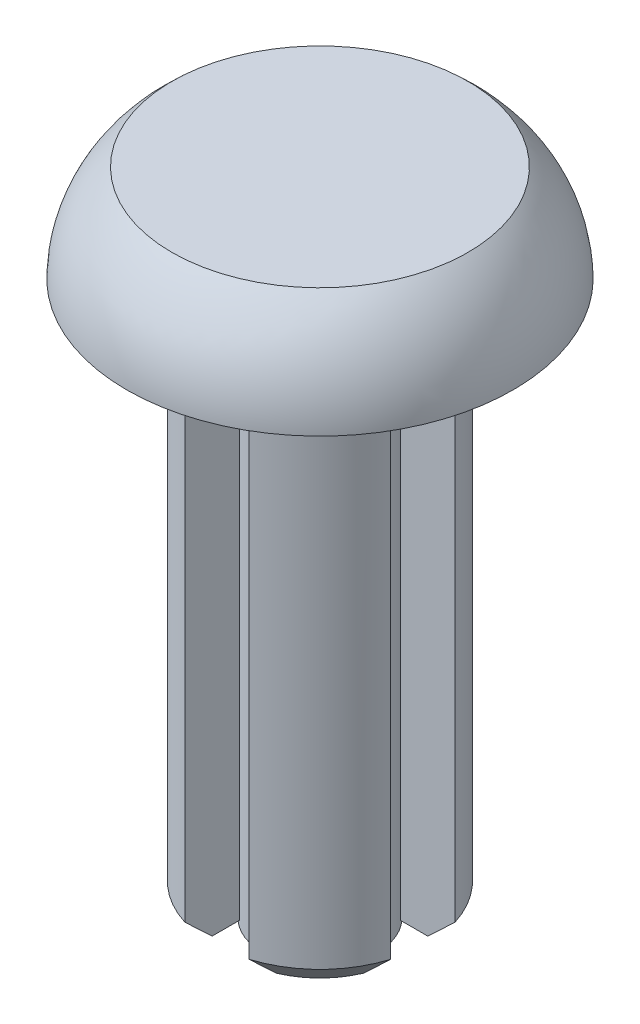
ISO-10303-21;
HEADER;
FILE_DESCRIPTION(('STEP AP214'),'2;1');
FILE_NAME('part.step','',(''),(''),'','','');
FILE_SCHEMA(('AUTOMOTIVE_DESIGN { 1 0 10303 214 1 1 1 1 }'));
ENDSEC;
DATA;
#1=APPLICATION_CONTEXT('core data for automotive mechanical design processes');
#2=APPLICATION_PROTOCOL_DEFINITION('international standard','automotive_design',2000,#1);
#3=PRODUCT_CONTEXT('',#1,'mechanical');
#4=PRODUCT('Part','Part','',(#3));
#5=PRODUCT_RELATED_PRODUCT_CATEGORY('part','',(#4));
#6=PRODUCT_DEFINITION_FORMATION('','',#4);
#7=PRODUCT_DEFINITION_CONTEXT('part definition',#1,'design');
#8=PRODUCT_DEFINITION('design','',#6,#7);
#9=PRODUCT_DEFINITION_SHAPE('','',#8);
#10=(LENGTH_UNIT() NAMED_UNIT(*) SI_UNIT(.MILLI.,.METRE.));
#11=(NAMED_UNIT(*) PLANE_ANGLE_UNIT() SI_UNIT($,.RADIAN.));
#12=(NAMED_UNIT(*) SI_UNIT($,.STERADIAN.) SOLID_ANGLE_UNIT());
#13=UNCERTAINTY_MEASURE_WITH_UNIT(LENGTH_MEASURE(1.E-05),#10,'distance_accuracy_value','');
#14=(GEOMETRIC_REPRESENTATION_CONTEXT(3) GLOBAL_UNCERTAINTY_ASSIGNED_CONTEXT((#13)) GLOBAL_UNIT_ASSIGNED_CONTEXT((#10,
#11,#12)) REPRESENTATION_CONTEXT('',''));
#15=CARTESIAN_POINT('',(0.,0.,0.));
#16=DIRECTION('',(0.,0.,1.));
#17=DIRECTION('',(1.,0.,0.));
#18=AXIS2_PLACEMENT_3D('',#15,#16,#17);
#19=CARTESIAN_POINT('',(0.,1.905,0.));
#20=DIRECTION('',(0.,1.,0.));
#21=DIRECTION('',(0.,0.,1.));
#22=AXIS2_PLACEMENT_3D('',#19,#20,#21);
#23=PLANE('',#22);
#24=CARTESIAN_POINT('',(0.,1.905,0.));
#25=DIRECTION('',(0.,1.,0.));
#26=DIRECTION('',(0.,0.,1.));
#27=AXIS2_PLACEMENT_3D('',#24,#25,#26);
#28=CIRCLE('',#27,2.921);
#29=CARTESIAN_POINT('',(0.,1.905,2.921));
#30=VERTEX_POINT('',#29);
#31=EDGE_CURVE('E19',#30,#30,#28,.F.);
#32=ORIENTED_EDGE('',*,*,#31,.F.);
#33=EDGE_LOOP('',(#32));
#34=FACE_BOUND('',#33,.T.);
#35=ADVANCED_FACE('F16',(#34),#23,.T.);
#36=CARTESIAN_POINT('',(0.,-11.4394,0.));
#37=DIRECTION('',(0.,-1.,0.));
#38=DIRECTION('',(0.,0.,-1.));
#39=AXIS2_PLACEMENT_3D('',#36,#37,#38);
#40=PLANE('',#39);
#41=CARTESIAN_POINT('',(0.,-11.4393999999152,0.));
#42=DIRECTION('',(0.,1.,0.));
#43=DIRECTION('',(0.,0.,1.));
#44=AXIS2_PLACEMENT_3D('',#41,#42,#43);
#45=CIRCLE('',#44,0.634999999988395);
#46=CARTESIAN_POINT('',(0.,-11.4393999999152,0.634999999988395));
#47=VERTEX_POINT('',#46);
#48=EDGE_CURVE('E163',#47,#47,#45,.T.);
#49=ORIENTED_EDGE('',*,*,#48,.F.);
#50=EDGE_LOOP('',(#49));
#51=FACE_BOUND('',#50,.T.);
#52=ADVANCED_FACE('F205',(#51),#40,.T.);
#53=CARTESIAN_POINT('',(0.,-0.0595861521909685,1.19674395959077));
#54=DIRECTION('',(1.,0.,0.));
#55=DIRECTION('',(0.,0.,1.));
#56=AXIS2_PLACEMENT_3D('',#53,#54,#55);
#57=CIRCLE('',#56,2.61393527889813);
#58=TRIMMED_CURVE('',#57,(PARAMETER_VALUE(-2.04635172054682)),
(PARAMETER_VALUE(2.04635172054682)),.T.,.PARAMETER.);
#59=CARTESIAN_POINT('',(0.,-0.0595861521909685,0.));
#60=DIRECTION('',(0.,1.,0.));
#61=AXIS1_PLACEMENT('',#59,#60);
#62=SURFACE_OF_REVOLUTION('',#58,#61);
#63=ORIENTED_EDGE('',*,*,#31,.T.);
#64=EDGE_LOOP('',(#63));
#65=FACE_BOUND('',#64,.T.);
#66=CARTESIAN_POINT('',(0.,0.,0.));
#67=DIRECTION('',(0.,1.,0.));
#68=DIRECTION('',(0.,0.,1.));
#69=AXIS2_PLACEMENT_3D('',#66,#67,#68);
#70=CIRCLE('',#69,3.80999999998721);
#71=CARTESIAN_POINT('',(0.,0.,3.80999999998721));
#72=VERTEX_POINT('',#71);
#73=EDGE_CURVE('E195',#72,#72,#70,.F.);
#74=ORIENTED_EDGE('',*,*,#73,.F.);
#75=EDGE_LOOP('',(#74));
#76=FACE_BOUND('',#75,.T.);
#77=ADVANCED_FACE('F201',(#65,#76),#62,.F.);
#78=CARTESIAN_POINT('',(0.,-10.8044,0.));
#79=DIRECTION('',(0.,-1.,0.));
#80=DIRECTION('',(0.,0.,-1.));
#81=AXIS2_PLACEMENT_3D('',#78,#79,#80);
#82=PLANE('',#81);
#83=DIRECTION('',(0.,0.,-1.));
#84=VECTOR('',#83,1.);
#85=CARTESIAN_POINT('',(0.635000000000001,-10.8044,2.03026292940102));
#86=LINE('',#85,#84);
#87=CARTESIAN_POINT('',(0.635000000000001,-10.8043999999918,1.48954542139407));
#88=VERTEX_POINT('',#87);
#89=CARTESIAN_POINT('',(0.635,-10.8044,0.950380976240581));
#90=VERTEX_POINT('',#89);
#91=EDGE_CURVE('E358',#88,#90,#86,.T.);
#92=ORIENTED_EDGE('',*,*,#91,.T.);
#93=CARTESIAN_POINT('',(0.,-10.8044,0.));
#94=DIRECTION('',(0.,1.,0.));
#95=DIRECTION('',(0.,0.,1.));
#96=AXIS2_PLACEMENT_3D('',#93,#94,#95);
#97=CIRCLE('',#96,1.143);
#98=CARTESIAN_POINT('',(0.950380976240581,-10.8044,0.635));
#99=VERTEX_POINT('',#98);
#100=EDGE_CURVE('E162',#99,#90,#97,.F.);
#101=ORIENTED_EDGE('',*,*,#100,.F.);
#102=DIRECTION('',(1.,0.,0.));
#103=VECTOR('',#102,1.);
#104=CARTESIAN_POINT('',(0.635,-10.8044,0.635));
#105=LINE('',#104,#103);
#106=CARTESIAN_POINT('',(1.48954542139407,-10.8043999999918,0.635));
#107=VERTEX_POINT('',#106);
#108=EDGE_CURVE('E189',#99,#107,#105,.T.);
#109=ORIENTED_EDGE('',*,*,#108,.T.);
#110=CARTESIAN_POINT('',(0.,-10.8043999999836,0.));
#111=DIRECTION('',(0.,1.,0.));
#112=DIRECTION('',(0.,0.,1.));
#113=AXIS2_PLACEMENT_3D('',#110,#111,#112);
#114=CIRCLE('',#113,1.61924999997609);
#115=EDGE_CURVE('E190',#88,#107,#114,.T.);
#116=ORIENTED_EDGE('',*,*,#115,.F.);
#117=EDGE_LOOP('',(#92,#101,#109,#116));
#118=FACE_BOUND('',#117,.T.);
#119=ADVANCED_FACE('F204',(#118),#82,.T.);
#120=CARTESIAN_POINT('',(0.,-10.8044,0.));
#121=DIRECTION('',(0.,-1.,0.));
#122=DIRECTION('',(0.,0.,-1.));
#123=AXIS2_PLACEMENT_3D('',#120,#121,#122);
#124=PLANE('',#123);
#125=DIRECTION('',(-1.,0.,0.));
#126=VECTOR('',#125,1.);
#127=CARTESIAN_POINT('',(0.635,-10.8044,-0.635));
#128=LINE('',#127,#126);
#129=CARTESIAN_POINT('',(1.48954542133228,-10.8043999999918,-0.635));
#130=VERTEX_POINT('',#129);
#131=CARTESIAN_POINT('',(0.950380976240581,-10.8044,-0.635));
#132=VERTEX_POINT('',#131);
#133=EDGE_CURVE('E166',#130,#132,#128,.T.);
#134=ORIENTED_EDGE('',*,*,#133,.T.);
#135=CARTESIAN_POINT('',(0.,-10.8044,0.));
#136=DIRECTION('',(0.,1.,0.));
#137=DIRECTION('',(0.,0.,1.));
#138=AXIS2_PLACEMENT_3D('',#135,#136,#137);
#139=CIRCLE('',#138,1.143);
#140=CARTESIAN_POINT('',(0.635,-10.8044,-0.950380976240581));
#141=VERTEX_POINT('',#140);
#142=EDGE_CURVE('E150',#141,#132,#139,.F.);
#143=ORIENTED_EDGE('',*,*,#142,.F.);
#144=DIRECTION('',(0.,0.,-1.));
#145=VECTOR('',#144,1.);
#146=CARTESIAN_POINT('',(0.635,-10.8044,-0.635));
#147=LINE('',#146,#145);
#148=CARTESIAN_POINT('',(0.635000000000001,-10.8043999999918,-1.48954542133228));
#149=VERTEX_POINT('',#148);
#150=EDGE_CURVE('E337',#141,#149,#147,.T.);
#151=ORIENTED_EDGE('',*,*,#150,.T.);
#152=CARTESIAN_POINT('',(0.,-10.8043999999836,0.));
#153=DIRECTION('',(0.,1.,0.));
#154=DIRECTION('',(0.,0.,1.));
#155=AXIS2_PLACEMENT_3D('',#152,#153,#154);
#156=CIRCLE('',#155,1.61924999991925);
#157=EDGE_CURVE('E169',#130,#149,#156,.T.);
#158=ORIENTED_EDGE('',*,*,#157,.F.);
#159=EDGE_LOOP('',(#134,#143,#151,#158));
#160=FACE_BOUND('',#159,.T.);
#161=ADVANCED_FACE('F167',(#160),#124,.T.);
#162=CARTESIAN_POINT('',(0.,-10.9313999999472,0.));
#163=DIRECTION('',(0.,1.,0.));
#164=DIRECTION('',(0.,0.,1.));
#165=AXIS2_PLACEMENT_3D('',#162,#163,#164);
#166=CONICAL_SURFACE('',#165,1.14299999995637,0.785398163397448);
#167=ORIENTED_EDGE('',*,*,#48,.T.);
#168=EDGE_LOOP('',(#167));
#169=FACE_BOUND('',#168,.T.);
#170=CARTESIAN_POINT('',(0.,-10.9314,0.));
#171=DIRECTION('',(0.,1.,0.));
#172=DIRECTION('',(0.,0.,1.));
#173=AXIS2_PLACEMENT_3D('',#170,#171,#172);
#174=CIRCLE('',#173,1.143);
#175=CARTESIAN_POINT('',(0.,-10.9314,1.143));
#176=VERTEX_POINT('',#175);
#177=EDGE_CURVE('E366',#176,#176,#174,.T.);
#178=ORIENTED_EDGE('',*,*,#177,.F.);
#179=EDGE_LOOP('',(#178));
#180=FACE_BOUND('',#179,.T.);
#181=ADVANCED_FACE('F433',(#169,#180),#166,.T.);
#182=CARTESIAN_POINT('',(0.,0.,0.));
#183=DIRECTION('',(0.,1.,0.));
#184=DIRECTION('',(0.,0.,1.));
#185=AXIS2_PLACEMENT_3D('',#182,#183,#184);
#186=CONICAL_SURFACE('',#185,3.80999999993037,1.54799877919605);
#187=ORIENTED_EDGE('',*,*,#73,.T.);
#188=EDGE_LOOP('',(#187));
#189=FACE_BOUND('',#188,.T.);
#190=CARTESIAN_POINT('',(0.,-0.0227955728942452,0.));
#191=DIRECTION('',(0.,1.,0.));
#192=DIRECTION('',(0.,0.,1.));
#193=AXIS2_PLACEMENT_3D('',#190,#191,#192);
#194=CIRCLE('',#193,2.81025985283353);
#195=CARTESIAN_POINT('',(0.,-0.0227955728942452,2.81025985283353));
#196=VERTEX_POINT('',#195);
#197=EDGE_CURVE('E324',#196,#196,#194,.T.);
#198=ORIENTED_EDGE('',*,*,#197,.T.);
#199=EDGE_LOOP('',(#198));
#200=FACE_BOUND('',#199,.T.);
#201=ADVANCED_FACE('F430',(#189,#200),#186,.T.);
#202=CARTESIAN_POINT('',(0.635000000000001,-0.644399999999998,2.03026292940102));
#203=DIRECTION('',(1.,0.,0.));
#204=DIRECTION('',(0.,0.,-1.));
#205=AXIS2_PLACEMENT_3D('',#202,#203,#204);
#206=PLANE('',#205);
#207=CARTESIAN_POINT('',(0.635000000000001,-10.2963999999739,2.03026292938615));
#208=CARTESIAN_POINT('',(0.635000000000001,-10.3390858324256,1.98553535088088));
#209=CARTESIAN_POINT('',(0.635000000000001,-10.3817085821733,1.94074736694082));
#210=CARTESIAN_POINT('',(0.635000000000001,-10.4667920637135,1.85101953980129));
#211=CARTESIAN_POINT('',(0.635000000000001,-10.5092527987847,1.80607969970996));
#212=CARTESIAN_POINT('',(0.635000000000001,-10.5939784631004,1.71601494909532));
#213=CARTESIAN_POINT('',(0.635000000000001,-10.6362433908405,1.67089003715512));
#214=CARTESIAN_POINT('',(0.635000000000001,-10.7205231739316,1.580405652873));
#215=CARTESIAN_POINT('',(0.635000000000001,-10.762538024149,1.53504617575149));
#216=CARTESIAN_POINT('',(0.635000000000001,-10.8043999999848,1.48954542140173));
#217=B_SPLINE_CURVE_WITH_KNOTS('',3,(#207,#208,#209,#210,#211,#212,#213,#214,#215,#216),
.UNSPECIFIED.,.F.,.F.,(4,2,2,2,4),(0.,0.185482565147711,0.370961356623039,0.556441570750558,
0.741925579300346),.UNSPECIFIED.);
#218=CARTESIAN_POINT('',(0.635000000000001,-10.296399999987,2.03026292939358));
#219=VERTEX_POINT('',#218);
#220=EDGE_CURVE('E361',#219,#88,#217,.T.);
#221=ORIENTED_EDGE('',*,*,#220,.F.);
#222=DIRECTION('',(0.,1.,0.));
#223=VECTOR('',#222,1.);
#224=CARTESIAN_POINT('',(0.635000000000001,-10.8044,2.03026292940102));
#225=LINE('',#224,#223);
#226=CARTESIAN_POINT('',(0.635000000000001,-0.644399999999998,2.03026292940102));
#227=VERTEX_POINT('',#226);
#228=EDGE_CURVE('E320',#227,#219,#225,.F.);
#229=ORIENTED_EDGE('',*,*,#228,.F.);
#230=DIRECTION('',(0.,0.,-1.));
#231=VECTOR('',#230,1.);
#232=CARTESIAN_POINT('',(0.635000000000001,-0.644399999999998,2.03026292940102));
#233=LINE('',#232,#231);
#234=CARTESIAN_POINT('',(0.635,-0.644399999999998,0.950380976240581));
#235=VERTEX_POINT('',#234);
#236=EDGE_CURVE('E194',#235,#227,#233,.F.);
#237=ORIENTED_EDGE('',*,*,#236,.F.);
#238=DIRECTION('',(0.,1.,0.));
#239=VECTOR('',#238,1.);
#240=CARTESIAN_POINT('',(0.635,-0.644399999999998,0.950380976240581));
#241=LINE('',#240,#239);
#242=EDGE_CURVE('E191',#90,#235,#241,.T.);
#243=ORIENTED_EDGE('',*,*,#242,.F.);
#244=ORIENTED_EDGE('',*,*,#91,.F.);
#245=EDGE_LOOP('',(#221,#229,#237,#243,#244));
#246=FACE_BOUND('',#245,.T.);
#247=ADVANCED_FACE('F413',(#246),#206,.F.);
#248=CARTESIAN_POINT('',(0.,-10.2963999999588,0.));
#249=DIRECTION('',(0.,1.,0.));
#250=DIRECTION('',(0.,0.,1.));
#251=AXIS2_PLACEMENT_3D('',#248,#249,#250);
#252=CONICAL_SURFACE('',#251,2.12725000000091,0.785398163397448);
#253=ORIENTED_EDGE('',*,*,#220,.T.);
#254=ORIENTED_EDGE('',*,*,#115,.T.);
#255=CARTESIAN_POINT('',(1.48954542140814,-10.8043999999789,0.635));
#256=CARTESIAN_POINT('',(1.53504617575691,-10.762538024144,0.635));
#257=CARTESIAN_POINT('',(1.58040565287744,-10.7205231739275,0.635));
#258=CARTESIAN_POINT('',(1.6708900371576,-10.6362433908382,0.635));
#259=CARTESIAN_POINT('',(1.71601494909682,-10.5939784630989,0.635));
#260=CARTESIAN_POINT('',(1.80607969970952,-10.5092527987851,0.635));
#261=CARTESIAN_POINT('',(1.85101953979988,-10.4667920637149,0.635));
#262=CARTESIAN_POINT('',(1.94074736693748,-10.3817085821765,0.635));
#263=CARTESIAN_POINT('',(1.98553535087658,-10.3390858324297,0.635));
#264=CARTESIAN_POINT('',(2.03026292938089,-10.2963999999789,0.635));
#265=B_SPLINE_CURVE_WITH_KNOTS('',3,(#255,#256,#257,#258,#259,#260,#261,#262,#263,#264),
.UNSPECIFIED.,.F.,.F.,(4,2,2,2,4),(0.,0.185484008545792,0.370964222669312,0.556443014140646,
0.74192557928436),.UNSPECIFIED.);
#266=CARTESIAN_POINT('',(2.03026292939095,-10.2963999999895,0.635));
#267=VERTEX_POINT('',#266);
#268=EDGE_CURVE('E351',#107,#267,#265,.T.);
#269=ORIENTED_EDGE('',*,*,#268,.T.);
#270=CARTESIAN_POINT('',(0.,-10.2964,0.));
#271=DIRECTION('',(0.,1.,0.));
#272=DIRECTION('',(0.,0.,1.));
#273=AXIS2_PLACEMENT_3D('',#270,#271,#272);
#274=CIRCLE('',#273,2.12725);
#275=EDGE_CURVE('E323',#219,#267,#274,.T.);
#276=ORIENTED_EDGE('',*,*,#275,.F.);
#277=EDGE_LOOP('',(#253,#254,#269,#276));
#278=FACE_BOUND('',#277,.T.);
#279=ADVANCED_FACE('F409',(#278),#252,.T.);
#280=CARTESIAN_POINT('',(0.635,-0.644399999999998,0.635));
#281=DIRECTION('',(0.,0.,1.));
#282=DIRECTION('',(1.,0.,0.));
#283=AXIS2_PLACEMENT_3D('',#280,#281,#282);
#284=PLANE('',#283);
#285=ORIENTED_EDGE('',*,*,#268,.F.);
#286=ORIENTED_EDGE('',*,*,#108,.F.);
#287=DIRECTION('',(0.,1.,0.));
#288=VECTOR('',#287,1.);
#289=CARTESIAN_POINT('',(0.950380976240581,-0.644399999999998,0.635));
#290=LINE('',#289,#288);
#291=CARTESIAN_POINT('',(0.950380976240581,-0.644399999999998,0.635));
#292=VERTEX_POINT('',#291);
#293=EDGE_CURVE('E186',#292,#99,#290,.F.);
#294=ORIENTED_EDGE('',*,*,#293,.F.);
#295=DIRECTION('',(1.,0.,0.));
#296=VECTOR('',#295,1.);
#297=CARTESIAN_POINT('',(0.,-0.644399999999998,0.635));
#298=LINE('',#297,#296);
#299=CARTESIAN_POINT('',(2.03026292940102,-0.644399999999998,0.635));
#300=VERTEX_POINT('',#299);
#301=EDGE_CURVE('E181',#300,#292,#298,.F.);
#302=ORIENTED_EDGE('',*,*,#301,.F.);
#303=DIRECTION('',(0.,1.,0.));
#304=VECTOR('',#303,1.);
#305=CARTESIAN_POINT('',(2.03026292940102,-10.8044,0.635));
#306=LINE('',#305,#304);
#307=EDGE_CURVE('E352',#267,#300,#306,.T.);
#308=ORIENTED_EDGE('',*,*,#307,.F.);
#309=EDGE_LOOP('',(#285,#286,#294,#302,#308));
#310=FACE_BOUND('',#309,.T.);
#311=ADVANCED_FACE('F407',(#310),#284,.F.);
#312=CARTESIAN_POINT('',(0.,-0.644399999999998,0.));
#313=DIRECTION('',(0.,-1.,0.));
#314=DIRECTION('',(0.,0.,-1.));
#315=AXIS2_PLACEMENT_3D('',#312,#313,#314);
#316=PLANE('',#315);
#317=DIRECTION('',(-1.,0.,0.));
#318=VECTOR('',#317,1.);
#319=CARTESIAN_POINT('',(0.635,-0.644399999999998,-0.635));
#320=LINE('',#319,#318);
#321=CARTESIAN_POINT('',(0.950380976240581,-0.644399999999998,-0.635));
#322=VERTEX_POINT('',#321);
#323=CARTESIAN_POINT('',(2.03026292940102,-0.644399999999998,-0.635));
#324=VERTEX_POINT('',#323);
#325=EDGE_CURVE('E173',#322,#324,#320,.F.);
#326=ORIENTED_EDGE('',*,*,#325,.T.);
#327=CARTESIAN_POINT('',(0.,-0.644399999999998,0.));
#328=DIRECTION('',(0.,1.,0.));
#329=DIRECTION('',(0.,0.,1.));
#330=AXIS2_PLACEMENT_3D('',#327,#328,#329);
#331=CIRCLE('',#330,2.12725);
#332=EDGE_CURVE('E347',#300,#324,#331,.T.);
#333=ORIENTED_EDGE('',*,*,#332,.F.);
#334=ORIENTED_EDGE('',*,*,#301,.T.);
#335=CARTESIAN_POINT('',(0.,-0.644399999999998,0.));
#336=DIRECTION('',(0.,1.,0.));
#337=DIRECTION('',(0.,0.,1.));
#338=AXIS2_PLACEMENT_3D('',#335,#336,#337);
#339=CIRCLE('',#338,1.143);
#340=EDGE_CURVE('E178',#292,#322,#339,.T.);
#341=ORIENTED_EDGE('',*,*,#340,.T.);
#342=EDGE_LOOP('',(#326,#333,#334,#341));
#343=FACE_BOUND('',#342,.T.);
#344=ADVANCED_FACE('F504',(#343),#316,.T.);
#345=CARTESIAN_POINT('',(0.635,-0.644399999999998,-0.635));
#346=DIRECTION('',(0.,0.,-1.));
#347=DIRECTION('',(-1.,0.,0.));
#348=AXIS2_PLACEMENT_3D('',#345,#346,#347);
#349=PLANE('',#348);
#350=CARTESIAN_POINT('',(2.03026292935776,-10.2963999999441,-0.635));
#351=CARTESIAN_POINT('',(1.98553535085204,-10.3390858323963,-0.635));
#352=CARTESIAN_POINT('',(1.94074736691151,-10.3817085821444,-0.635));
#353=CARTESIAN_POINT('',(1.85101953977105,-10.4667920636853,-0.635));
#354=CARTESIAN_POINT('',(1.80607969967926,-10.5092527987568,-0.635));
#355=CARTESIAN_POINT('',(1.71601494906366,-10.5939784630732,-0.635));
#356=CARTESIAN_POINT('',(1.67089003712298,-10.6362433908137,-0.635));
#357=CARTESIAN_POINT('',(1.58040565283988,-10.7205231739055,-0.635));
#358=CARTESIAN_POINT('',(1.53504617571787,-10.7625380241232,-0.635));
#359=CARTESIAN_POINT('',(1.4895454213676,-10.8043999999593,-0.635));
#360=B_SPLINE_CURVE_WITH_KNOTS('',3,(#350,#351,#352,#353,#354,#355,#356,#357,#358,#359),
.UNSPECIFIED.,.F.,.F.,(4,2,2,2,4),(0.,0.185482565149494,0.370961356626607,0.556441570755906,
0.741925579307479),.UNSPECIFIED.);
#361=CARTESIAN_POINT('',(2.03026292937939,-10.2963999999721,-0.635));
#362=VERTEX_POINT('',#361);
#363=EDGE_CURVE('E172',#362,#130,#360,.T.);
#364=ORIENTED_EDGE('',*,*,#363,.F.);
#365=DIRECTION('',(0.,1.,0.));
#366=VECTOR('',#365,1.);
#367=CARTESIAN_POINT('',(2.03026292940102,-10.8044,-0.635));
#368=LINE('',#367,#366);
#369=EDGE_CURVE('E342',#324,#362,#368,.F.);
#370=ORIENTED_EDGE('',*,*,#369,.F.);
#371=ORIENTED_EDGE('',*,*,#325,.F.);
#372=DIRECTION('',(0.,1.,0.));
#373=VECTOR('',#372,1.);
#374=CARTESIAN_POINT('',(0.950380976240581,-0.644399999999998,-0.635));
#375=LINE('',#374,#373);
#376=EDGE_CURVE('E155',#132,#322,#375,.T.);
#377=ORIENTED_EDGE('',*,*,#376,.F.);
#378=ORIENTED_EDGE('',*,*,#133,.F.);
#379=EDGE_LOOP('',(#364,#370,#371,#377,#378));
#380=FACE_BOUND('',#379,.T.);
#381=ADVANCED_FACE('F176',(#380),#349,.F.);
#382=CARTESIAN_POINT('',(0.,-10.2964000000156,0.));
#383=DIRECTION('',(0.,1.,0.));
#384=DIRECTION('',(0.,0.,1.));
#385=AXIS2_PLACEMENT_3D('',#382,#383,#384);
#386=CONICAL_SURFACE('',#385,2.12724999988723,0.785398163397448);
#387=ORIENTED_EDGE('',*,*,#363,.T.);
#388=ORIENTED_EDGE('',*,*,#157,.T.);
#389=CARTESIAN_POINT('',(0.635000000015535,-10.8043999999619,-1.48954542138207));
#390=CARTESIAN_POINT('',(0.63500000000561,-10.7625380241212,-1.53504617572625));
#391=CARTESIAN_POINT('',(0.635000000001511,-10.7205231739021,-1.58040565284516));
#392=CARTESIAN_POINT('',(0.63499999999849,-10.6362433908105,-1.67089003712473));
#393=CARTESIAN_POINT('',(0.634999999999569,-10.5939784630715,-1.71601494906497));
#394=CARTESIAN_POINT('',(0.635000000000432,-10.5092527987574,-1.80607969967905));
#395=CARTESIAN_POINT('',(0.635000000000217,-10.4667920636867,-1.85101953976977));
#396=CARTESIAN_POINT('',(0.634999999999785,-10.3817085821474,-1.94074736690808));
#397=CARTESIAN_POINT('',(0.634999999999569,-10.3390858324001,-1.98553535084752));
#398=CARTESIAN_POINT('',(0.635000000000001,-10.2963999999492,-2.0302629293525));
#399=B_SPLINE_CURVE_WITH_KNOTS('',3,(#389,#390,#391,#392,#393,#394,#395,#396,#397,#398),
.UNSPECIFIED.,.F.,.F.,(4,2,2,2,4),(0.,0.185484008547495,0.370964222672752,0.556443014145866,
0.741925579291334),.UNSPECIFIED.);
#400=CARTESIAN_POINT('',(0.635000000000001,-10.2963999999746,-2.03026292937676));
#401=VERTEX_POINT('',#400);
#402=EDGE_CURVE('E339',#149,#401,#399,.T.);
#403=ORIENTED_EDGE('',*,*,#402,.T.);
#404=CARTESIAN_POINT('',(0.,-10.2964,0.));
#405=DIRECTION('',(0.,1.,0.));
#406=DIRECTION('',(0.,0.,1.));
#407=AXIS2_PLACEMENT_3D('',#404,#405,#406);
#408=CIRCLE('',#407,2.12725);
#409=EDGE_CURVE('E336',#362,#401,#408,.T.);
#410=ORIENTED_EDGE('',*,*,#409,.F.);
#411=EDGE_LOOP('',(#387,#388,#403,#410));
#412=FACE_BOUND('',#411,.T.);
#413=ADVANCED_FACE('F389',(#412),#386,.T.);
#414=CARTESIAN_POINT('',(0.635,-0.644399999999998,-0.635));
#415=DIRECTION('',(1.,0.,0.));
#416=DIRECTION('',(0.,0.,-1.));
#417=AXIS2_PLACEMENT_3D('',#414,#415,#416);
#418=PLANE('',#417);
#419=ORIENTED_EDGE('',*,*,#402,.F.);
#420=ORIENTED_EDGE('',*,*,#150,.F.);
#421=DIRECTION('',(0.,1.,0.));
#422=VECTOR('',#421,1.);
#423=CARTESIAN_POINT('',(0.635,-0.644399999999998,-0.950380976240581));
#424=LINE('',#423,#422);
#425=CARTESIAN_POINT('',(0.635,-0.644399999999998,-0.950380976240581));
#426=VERTEX_POINT('',#425);
#427=EDGE_CURVE('E159',#426,#141,#424,.F.);
#428=ORIENTED_EDGE('',*,*,#427,.F.);
#429=DIRECTION('',(0.,0.,-1.));
#430=VECTOR('',#429,1.);
#431=CARTESIAN_POINT('',(0.635,-0.644399999999998,-0.635));
#432=LINE('',#431,#430);
#433=CARTESIAN_POINT('',(0.635000000000001,-0.644399999999998,-2.03026292940102));
#434=VERTEX_POINT('',#433);
#435=EDGE_CURVE('E343',#434,#426,#432,.F.);
#436=ORIENTED_EDGE('',*,*,#435,.F.);
#437=DIRECTION('',(0.,1.,0.));
#438=VECTOR('',#437,1.);
#439=CARTESIAN_POINT('',(0.635000000000002,-10.8044,-2.03026292940102));
#440=LINE('',#439,#438);
#441=EDGE_CURVE('E333',#401,#434,#440,.T.);
#442=ORIENTED_EDGE('',*,*,#441,.F.);
#443=EDGE_LOOP('',(#419,#420,#428,#436,#442));
#444=FACE_BOUND('',#443,.T.);
#445=ADVANCED_FACE('F386',(#444),#418,.F.);
#446=CARTESIAN_POINT('',(0.,-10.8044,0.));
#447=DIRECTION('',(0.,-1.,0.));
#448=DIRECTION('',(0.,0.,-1.));
#449=AXIS2_PLACEMENT_3D('',#446,#447,#448);
#450=PLANE('',#449);
#451=DIRECTION('',(0.,0.,1.));
#452=VECTOR('',#451,1.);
#453=CARTESIAN_POINT('',(-0.635,-10.8044,-0.635));
#454=LINE('',#453,#452);
#455=CARTESIAN_POINT('',(-0.635,-10.8043999999634,-1.48954542136318));
#456=VERTEX_POINT('',#455);
#457=CARTESIAN_POINT('',(-0.635,-10.8044,-0.950380976240581));
#458=VERTEX_POINT('',#457);
#459=EDGE_CURVE('E296',#456,#458,#454,.T.);
#460=ORIENTED_EDGE('',*,*,#459,.T.);
#461=CARTESIAN_POINT('',(0.,-10.8044,0.));
#462=DIRECTION('',(0.,1.,0.));
#463=DIRECTION('',(0.,0.,1.));
#464=AXIS2_PLACEMENT_3D('',#461,#462,#463);
#465=CIRCLE('',#464,1.143);
#466=CARTESIAN_POINT('',(-0.950380976240581,-10.8044,-0.635));
#467=VERTEX_POINT('',#466);
#468=EDGE_CURVE('E371',#467,#458,#465,.F.);
#469=ORIENTED_EDGE('',*,*,#468,.F.);
#470=DIRECTION('',(-1.,0.,0.));
#471=VECTOR('',#470,1.);
#472=CARTESIAN_POINT('',(-2.03026292940102,-10.8044,-0.635));
#473=LINE('',#472,#471);
#474=CARTESIAN_POINT('',(-1.48954542136318,-10.8043999999634,-0.635));
#475=VERTEX_POINT('',#474);
#476=EDGE_CURVE('E285',#467,#475,#473,.T.);
#477=ORIENTED_EDGE('',*,*,#476,.T.);
#478=CARTESIAN_POINT('',(0.,-10.8043999999268,0.));
#479=DIRECTION('',(0.,1.,0.));
#480=DIRECTION('',(0.,0.,1.));
#481=AXIS2_PLACEMENT_3D('',#478,#479,#480);
#482=CIRCLE('',#481,1.61924999997609);
#483=EDGE_CURVE('E286',#456,#475,#482,.T.);
#484=ORIENTED_EDGE('',*,*,#483,.F.);
#485=EDGE_LOOP('',(#460,#469,#477,#484));
#486=FACE_BOUND('',#485,.T.);
#487=ADVANCED_FACE('F478',(#486),#450,.T.);
#488=CARTESIAN_POINT('',(0.,-11.4394,0.));
#489=DIRECTION('',(0.,1.,0.));
#490=DIRECTION('',(0.,0.,1.));
#491=AXIS2_PLACEMENT_3D('',#488,#489,#490);
#492=CYLINDRICAL_SURFACE('',#491,1.143);
#493=ORIENTED_EDGE('',*,*,#177,.T.);
#494=EDGE_LOOP('',(#493));
#495=FACE_BOUND('',#494,.T.);
#496=DIRECTION('',(0.,1.,0.));
#497=VECTOR('',#496,1.);
#498=CARTESIAN_POINT('',(-0.635,-0.644399999999998,-0.950380976240581));
#499=LINE('',#498,#497);
#500=CARTESIAN_POINT('',(-0.635,-0.644399999999998,-0.950380976240581));
#501=VERTEX_POINT('',#500);
#502=EDGE_CURVE('E331',#458,#501,#499,.T.);
#503=ORIENTED_EDGE('',*,*,#502,.T.);
#504=CARTESIAN_POINT('',(0.,-0.644399999999998,0.));
#505=DIRECTION('',(0.,1.,0.));
#506=DIRECTION('',(0.,0.,1.));
#507=AXIS2_PLACEMENT_3D('',#504,#505,#506);
#508=CIRCLE('',#507,1.143);
#509=EDGE_CURVE('E297',#426,#501,#508,.T.);
#510=ORIENTED_EDGE('',*,*,#509,.F.);
#511=ORIENTED_EDGE('',*,*,#427,.T.);
#512=ORIENTED_EDGE('',*,*,#142,.T.);
#513=ORIENTED_EDGE('',*,*,#376,.T.);
#514=ORIENTED_EDGE('',*,*,#340,.F.);
#515=ORIENTED_EDGE('',*,*,#293,.T.);
#516=ORIENTED_EDGE('',*,*,#100,.T.);
#517=ORIENTED_EDGE('',*,*,#242,.T.);
#518=CARTESIAN_POINT('',(0.,-0.644399999999998,0.));
#519=DIRECTION('',(0.,1.,0.));
#520=DIRECTION('',(0.,0.,1.));
#521=AXIS2_PLACEMENT_3D('',#518,#519,#520);
#522=CIRCLE('',#521,1.143);
#523=CARTESIAN_POINT('',(-0.635,-0.644399999999998,0.950380976240581));
#524=VERTEX_POINT('',#523);
#525=EDGE_CURVE('E368',#235,#524,#522,.F.);
#526=ORIENTED_EDGE('',*,*,#525,.T.);
#527=DIRECTION('',(0.,1.,0.));
#528=VECTOR('',#527,1.);
#529=CARTESIAN_POINT('',(-0.635,-0.644399999999998,0.950380976240581));
#530=LINE('',#529,#528);
#531=CARTESIAN_POINT('',(-0.635,-10.8044,0.950380976240581));
#532=VERTEX_POINT('',#531);
#533=EDGE_CURVE('E252',#524,#532,#530,.F.);
#534=ORIENTED_EDGE('',*,*,#533,.T.);
#535=CARTESIAN_POINT('',(0.,-10.8044,0.));
#536=DIRECTION('',(0.,1.,0.));
#537=DIRECTION('',(0.,0.,1.));
#538=AXIS2_PLACEMENT_3D('',#535,#536,#537);
#539=CIRCLE('',#538,1.143);
#540=CARTESIAN_POINT('',(-0.950380976240581,-10.8044,0.635));
#541=VERTEX_POINT('',#540);
#542=EDGE_CURVE('E365',#541,#532,#539,.T.);
#543=ORIENTED_EDGE('',*,*,#542,.F.);
#544=DIRECTION('',(0.,1.,0.));
#545=VECTOR('',#544,1.);
#546=CARTESIAN_POINT('',(-0.950380976240581,-0.644399999999998,0.635));
#547=LINE('',#546,#545);
#548=CARTESIAN_POINT('',(-0.950380976240581,-0.644399999999998,0.635));
#549=VERTEX_POINT('',#548);
#550=EDGE_CURVE('E326',#541,#549,#547,.T.);
#551=ORIENTED_EDGE('',*,*,#550,.T.);
#552=CARTESIAN_POINT('',(0.,-0.644399999999998,0.));
#553=DIRECTION('',(0.,1.,0.));
#554=DIRECTION('',(0.,0.,1.));
#555=AXIS2_PLACEMENT_3D('',#552,#553,#554);
#556=CIRCLE('',#555,1.143);
#557=CARTESIAN_POINT('',(-0.950380976240581,-0.644399999999998,-0.635));
#558=VERTEX_POINT('',#557);
#559=EDGE_CURVE('E260',#558,#549,#556,.T.);
#560=ORIENTED_EDGE('',*,*,#559,.F.);
#561=DIRECTION('',(0.,1.,0.));
#562=VECTOR('',#561,1.);
#563=CARTESIAN_POINT('',(-0.950380976240581,-0.644399999999998,-0.635));
#564=LINE('',#563,#562);
#565=EDGE_CURVE('E289',#558,#467,#564,.F.);
#566=ORIENTED_EDGE('',*,*,#565,.T.);
#567=ORIENTED_EDGE('',*,*,#468,.T.);
#568=EDGE_LOOP('',(#503,#510,#511,#512,#513,#514,#515,#516,#517,#526,#534,#543,#551,#560,#566,#567));
#569=FACE_BOUND('',#568,.T.);
#570=ADVANCED_FACE('F152',(#495,#569),#492,.T.);
#571=CARTESIAN_POINT('',(0.,-10.8044,0.));
#572=DIRECTION('',(0.,-1.,0.));
#573=DIRECTION('',(0.,0.,-1.));
#574=AXIS2_PLACEMENT_3D('',#571,#572,#573);
#575=PLANE('',#574);
#576=DIRECTION('',(1.,0.,0.));
#577=VECTOR('',#576,1.);
#578=CARTESIAN_POINT('',(-2.03026292940102,-10.8044,0.635));
#579=LINE('',#578,#577);
#580=CARTESIAN_POINT('',(-1.48954542145587,-10.8043999999918,0.635));
#581=VERTEX_POINT('',#580);
#582=EDGE_CURVE('E259',#581,#541,#579,.T.);
#583=ORIENTED_EDGE('',*,*,#582,.T.);
#584=ORIENTED_EDGE('',*,*,#542,.T.);
#585=DIRECTION('',(0.,0.,1.));
#586=VECTOR('',#585,1.);
#587=CARTESIAN_POINT('',(-0.634999999999999,-10.8044,2.03026292940102));
#588=LINE('',#587,#586);
#589=CARTESIAN_POINT('',(-0.635,-10.8043999999918,1.48954542145586));
#590=VERTEX_POINT('',#589);
#591=EDGE_CURVE('E246',#532,#590,#588,.T.);
#592=ORIENTED_EDGE('',*,*,#591,.T.);
#593=CARTESIAN_POINT('',(0.,-10.8043999999836,0.));
#594=DIRECTION('',(0.,1.,0.));
#595=DIRECTION('',(0.,0.,1.));
#596=AXIS2_PLACEMENT_3D('',#593,#594,#595);
#597=CIRCLE('',#596,1.61925000003293);
#598=EDGE_CURVE('E249',#581,#590,#597,.T.);
#599=ORIENTED_EDGE('',*,*,#598,.F.);
#600=EDGE_LOOP('',(#583,#584,#592,#599));
#601=FACE_BOUND('',#600,.T.);
#602=ADVANCED_FACE('F312',(#601),#575,.T.);
#603=CARTESIAN_POINT('',(0.,-0.0595861521909685,1.19674395959077));
#604=DIRECTION('',(1.,0.,0.));
#605=DIRECTION('',(0.,0.,1.));
#606=AXIS2_PLACEMENT_3D('',#603,#604,#605);
#607=CIRCLE('',#606,1.61393527889813);
#608=TRIMMED_CURVE('',#607,(PARAMETER_VALUE(-2.40610967080242)),
(PARAMETER_VALUE(2.40610967080242)),.T.,.PARAMETER.);
#609=CARTESIAN_POINT('',(0.,-0.0595861521909685,0.));
#610=DIRECTION('',(0.,1.,0.));
#611=AXIS1_PLACEMENT('',#609,#610);
#612=SURFACE_OF_REVOLUTION('',#608,#611);
#613=ORIENTED_EDGE('',*,*,#197,.F.);
#614=EDGE_LOOP('',(#613));
#615=FACE_BOUND('',#614,.T.);
#616=CARTESIAN_POINT('',(0.,0.905000000000001,0.));
#617=DIRECTION('',(0.,1.,0.));
#618=DIRECTION('',(0.,0.,1.));
#619=AXIS2_PLACEMENT_3D('',#616,#617,#618);
#620=CIRCLE('',#619,2.49071484004883);
#621=CARTESIAN_POINT('',(0.,0.905000000000001,2.49071484004883));
#622=VERTEX_POINT('',#621);
#623=EDGE_CURVE('E247',#622,#622,#620,.T.);
#624=ORIENTED_EDGE('',*,*,#623,.T.);
#625=EDGE_LOOP('',(#624));
#626=FACE_BOUND('',#625,.T.);
#627=ADVANCED_FACE('F307',(#615,#626),#612,.T.);
#628=CARTESIAN_POINT('',(0.,-0.644399999999998,0.));
#629=DIRECTION('',(0.,-1.,0.));
#630=DIRECTION('',(0.,0.,-1.));
#631=AXIS2_PLACEMENT_3D('',#628,#629,#630);
#632=PLANE('',#631);
#633=CARTESIAN_POINT('',(0.,-0.644399999999998,0.));
#634=DIRECTION('',(0.,1.,0.));
#635=DIRECTION('',(0.,0.,1.));
#636=AXIS2_PLACEMENT_3D('',#633,#634,#635);
#637=CIRCLE('',#636,2.12725);
#638=CARTESIAN_POINT('',(-0.634999999999999,-0.644399999999998,-2.03026292940102));
#639=VERTEX_POINT('',#638);
#640=EDGE_CURVE('E439',#434,#639,#637,.T.);
#641=ORIENTED_EDGE('',*,*,#640,.F.);
#642=ORIENTED_EDGE('',*,*,#435,.T.);
#643=ORIENTED_EDGE('',*,*,#509,.T.);
#644=DIRECTION('',(0.,0.,1.));
#645=VECTOR('',#644,1.);
#646=CARTESIAN_POINT('',(-0.635,-0.644399999999998,-0.635));
#647=LINE('',#646,#645);
#648=EDGE_CURVE('E318',#501,#639,#647,.F.);
#649=ORIENTED_EDGE('',*,*,#648,.T.);
#650=EDGE_LOOP('',(#641,#642,#643,#649));
#651=FACE_BOUND('',#650,.T.);
#652=ADVANCED_FACE('F303',(#651),#632,.T.);
#653=CARTESIAN_POINT('',(-0.635,-0.644399999999998,-0.635));
#654=DIRECTION('',(-1.,0.,0.));
#655=DIRECTION('',(0.,0.,1.));
#656=AXIS2_PLACEMENT_3D('',#653,#654,#655);
#657=PLANE('',#656);
#658=CARTESIAN_POINT('',(-0.634999999999999,-10.2963999999509,-2.03026292935066));
#659=CARTESIAN_POINT('',(-0.634999999999999,-10.3390858324007,-1.98553535084739));
#660=CARTESIAN_POINT('',(-0.634999999999999,-10.3817085821464,-1.94074736690933));
#661=CARTESIAN_POINT('',(-0.634999999999999,-10.4667920636827,-1.8510195397738));
#662=CARTESIAN_POINT('',(-0.634999999999999,-10.5092527987519,-1.80607969968448));
#663=CARTESIAN_POINT('',(-0.634999999999999,-10.5939784630636,-1.71601494907386));
#664=CARTESIAN_POINT('',(-0.635,-10.6362433908019,-1.67089003713568));
#665=CARTESIAN_POINT('',(-0.635,-10.720523173889,-1.5804056528576));
#666=CARTESIAN_POINT('',(-0.635,-10.7625380241045,-1.53504617573812));
#667=CARTESIAN_POINT('',(-0.635,-10.8043999999383,-1.4895454213904));
#668=B_SPLINE_CURVE_WITH_KNOTS('',3,(#658,#659,#660,#661,#662,#663,#664,#665,#666,#667),
.UNSPECIFIED.,.F.,.F.,(4,2,2,2,4),(0.,0.185482565139296,0.370961356606208,0.55644157072531,
0.741925579266682),.UNSPECIFIED.);
#669=CARTESIAN_POINT('',(-0.634999999999999,-10.2963999999755,-2.03026292937584));
#670=VERTEX_POINT('',#669);
#671=EDGE_CURVE('E290',#670,#456,#668,.T.);
#672=ORIENTED_EDGE('',*,*,#671,.F.);
#673=DIRECTION('',(0.,1.,0.));
#674=VECTOR('',#673,1.);
#675=CARTESIAN_POINT('',(-0.634999999999999,-10.8044,-2.03026292940102));
#676=LINE('',#675,#674);
#677=EDGE_CURVE('E441',#639,#670,#676,.F.);
#678=ORIENTED_EDGE('',*,*,#677,.F.);
#679=ORIENTED_EDGE('',*,*,#648,.F.);
#680=ORIENTED_EDGE('',*,*,#502,.F.);
#681=ORIENTED_EDGE('',*,*,#459,.F.);
#682=EDGE_LOOP('',(#672,#678,#679,#680,#681));
#683=FACE_BOUND('',#682,.T.);
#684=ADVANCED_FACE('F299',(#683),#657,.F.);
#685=CARTESIAN_POINT('',(0.,-10.2964000000725,0.));
#686=DIRECTION('',(0.,1.,0.));
#687=DIRECTION('',(0.,0.,1.));
#688=AXIS2_PLACEMENT_3D('',#685,#686,#687);
#689=CONICAL_SURFACE('',#688,2.12724999983038,0.785398163397448);
#690=ORIENTED_EDGE('',*,*,#671,.T.);
#691=ORIENTED_EDGE('',*,*,#483,.T.);
#692=CARTESIAN_POINT('',(-1.48954542138549,-10.8043999999429,-0.635));
#693=CARTESIAN_POINT('',(-1.53504617573378,-10.7625380241085,-0.635));
#694=CARTESIAN_POINT('',(-1.58040565285384,-10.7205231738925,-0.635));
#695=CARTESIAN_POINT('',(-1.67089003713305,-10.6362433908043,-0.635));
#696=CARTESIAN_POINT('',(-1.71601494907179,-10.5939784630656,-0.635));
#697=CARTESIAN_POINT('',(-1.80607969968353,-10.5092527987528,-0.635));
#698=CARTESIAN_POINT('',(-1.85101953977342,-10.4667920636831,-0.635));
#699=CARTESIAN_POINT('',(-1.94074736691005,-10.3817085821457,-0.635));
#700=CARTESIAN_POINT('',(-1.98553535084867,-10.3390858323995,-0.635));
#701=CARTESIAN_POINT('',(-2.0302629293525,-10.2963999999492,-0.635));
#702=B_SPLINE_CURVE_WITH_KNOTS('',3,(#692,#693,#694,#695,#696,#697,#698,#699,#700,#701),
.UNSPECIFIED.,.F.,.F.,(4,2,2,2,4),(0.,0.185484008543677,0.37096422266508,0.556443014134299,
0.741925579275895),.UNSPECIFIED.);
#703=CARTESIAN_POINT('',(-2.03026292937676,-10.2963999999746,-0.635));
#704=VERTEX_POINT('',#703);
#705=EDGE_CURVE('E279',#475,#704,#702,.T.);
#706=ORIENTED_EDGE('',*,*,#705,.T.);
#707=CARTESIAN_POINT('',(0.,-10.2964,0.));
#708=DIRECTION('',(0.,1.,0.));
#709=DIRECTION('',(0.,0.,1.));
#710=AXIS2_PLACEMENT_3D('',#707,#708,#709);
#711=CIRCLE('',#710,2.12725);
#712=EDGE_CURVE('E463',#670,#704,#711,.T.);
#713=ORIENTED_EDGE('',*,*,#712,.F.);
#714=EDGE_LOOP('',(#690,#691,#706,#713));
#715=FACE_BOUND('',#714,.T.);
#716=ADVANCED_FACE('F275',(#715),#689,.T.);
#717=CARTESIAN_POINT('',(-2.03026292940102,-0.644399999999998,-0.635));
#718=DIRECTION('',(0.,0.,-1.));
#719=DIRECTION('',(-1.,0.,0.));
#720=AXIS2_PLACEMENT_3D('',#717,#718,#719);
#721=PLANE('',#720);
#722=ORIENTED_EDGE('',*,*,#705,.F.);
#723=ORIENTED_EDGE('',*,*,#476,.F.);
#724=ORIENTED_EDGE('',*,*,#565,.F.);
#725=DIRECTION('',(1.,0.,0.));
#726=VECTOR('',#725,1.);
#727=CARTESIAN_POINT('',(0.,-0.644399999999998,-0.634999999999999));
#728=LINE('',#727,#726);
#729=CARTESIAN_POINT('',(-2.03026292940102,-0.644399999999998,-0.635));
#730=VERTEX_POINT('',#729);
#731=EDGE_CURVE('E284',#730,#558,#728,.T.);
#732=ORIENTED_EDGE('',*,*,#731,.F.);
#733=DIRECTION('',(0.,1.,0.));
#734=VECTOR('',#733,1.);
#735=CARTESIAN_POINT('',(-2.03026292940102,-10.8044,-0.635));
#736=LINE('',#735,#734);
#737=EDGE_CURVE('E460',#704,#730,#736,.T.);
#738=ORIENTED_EDGE('',*,*,#737,.F.);
#739=EDGE_LOOP('',(#722,#723,#724,#732,#738));
#740=FACE_BOUND('',#739,.T.);
#741=ADVANCED_FACE('F270',(#740),#721,.F.);
#742=CARTESIAN_POINT('',(0.,-0.644399999999998,0.));
#743=DIRECTION('',(0.,-1.,0.));
#744=DIRECTION('',(0.,0.,-1.));
#745=AXIS2_PLACEMENT_3D('',#742,#743,#744);
#746=PLANE('',#745);
#747=DIRECTION('',(1.,0.,0.));
#748=VECTOR('',#747,1.);
#749=CARTESIAN_POINT('',(-2.03026292940102,-0.644399999999998,0.635));
#750=LINE('',#749,#748);
#751=CARTESIAN_POINT('',(-2.03026292940102,-0.644399999999998,0.635));
#752=VERTEX_POINT('',#751);
#753=EDGE_CURVE('E328',#549,#752,#750,.F.);
#754=ORIENTED_EDGE('',*,*,#753,.T.);
#755=CARTESIAN_POINT('',(0.,-0.644399999999998,0.));
#756=DIRECTION('',(0.,1.,0.));
#757=DIRECTION('',(0.,0.,1.));
#758=AXIS2_PLACEMENT_3D('',#755,#756,#757);
#759=CIRCLE('',#758,2.12725);
#760=EDGE_CURVE('E454',#730,#752,#759,.T.);
#761=ORIENTED_EDGE('',*,*,#760,.F.);
#762=ORIENTED_EDGE('',*,*,#731,.T.);
#763=ORIENTED_EDGE('',*,*,#559,.T.);
#764=EDGE_LOOP('',(#754,#761,#762,#763));
#765=FACE_BOUND('',#764,.T.);
#766=ADVANCED_FACE('F266',(#765),#746,.T.);
#767=CARTESIAN_POINT('',(-2.03026292940102,-0.644399999999998,0.635));
#768=DIRECTION('',(0.,0.,1.));
#769=DIRECTION('',(1.,0.,0.));
#770=AXIS2_PLACEMENT_3D('',#767,#768,#769);
#771=PLANE('',#770);
#772=CARTESIAN_POINT('',(-2.03026292940744,-10.2964000000104,0.635));
#773=CARTESIAN_POINT('',(-1.98553535090413,-10.3390858324603,0.635));
#774=CARTESIAN_POINT('',(-1.94074736696604,-10.3817085822062,0.635));
#775=CARTESIAN_POINT('',(-1.85101953983045,-10.4667920637428,0.635));
#776=CARTESIAN_POINT('',(-1.80607969974111,-10.5092527988121,0.635));
#777=CARTESIAN_POINT('',(-1.71601494913046,-10.5939784631242,0.635));
#778=CARTESIAN_POINT('',(-1.67089003719227,-10.6362433908626,0.635));
#779=CARTESIAN_POINT('',(-1.58040565291421,-10.7205231739502,0.635));
#780=CARTESIAN_POINT('',(-1.53504617579474,-10.7625380241659,0.635));
#781=CARTESIAN_POINT('',(-1.48954542144705,-10.8043999999999,0.635));
#782=B_SPLINE_CURVE_WITH_KNOTS('',3,(#772,#773,#774,#775,#776,#777,#778,#779,#780,#781),
.UNSPECIFIED.,.F.,.F.,(4,2,2,2,4),(0.,0.185482565139676,0.370961356606971,0.556441570726454,
0.741925579268205),.UNSPECIFIED.);
#783=CARTESIAN_POINT('',(-2.03026292940423,-10.2964000000052,0.635));
#784=VERTEX_POINT('',#783);
#785=EDGE_CURVE('E253',#784,#581,#782,.T.);
#786=ORIENTED_EDGE('',*,*,#785,.F.);
#787=DIRECTION('',(0.,1.,0.));
#788=VECTOR('',#787,1.);
#789=CARTESIAN_POINT('',(-2.03026292940102,-10.8044,0.634999999999999));
#790=LINE('',#789,#788);
#791=EDGE_CURVE('E451',#752,#784,#790,.F.);
#792=ORIENTED_EDGE('',*,*,#791,.F.);
#793=ORIENTED_EDGE('',*,*,#753,.F.);
#794=ORIENTED_EDGE('',*,*,#550,.F.);
#795=ORIENTED_EDGE('',*,*,#582,.F.);
#796=EDGE_LOOP('',(#786,#792,#793,#794,#795));
#797=FACE_BOUND('',#796,.T.);
#798=ADVANCED_FACE('F262',(#797),#771,.F.);
#799=CARTESIAN_POINT('',(0.,-10.2964000000725,0.));
#800=DIRECTION('',(0.,1.,0.));
#801=DIRECTION('',(0.,0.,1.));
#802=AXIS2_PLACEMENT_3D('',#799,#800,#801);
#803=CONICAL_SURFACE('',#802,2.12724999994407,0.785398163397448);
#804=ORIENTED_EDGE('',*,*,#785,.T.);
#805=ORIENTED_EDGE('',*,*,#598,.T.);
#806=CARTESIAN_POINT('',(-0.635,-10.8044000000044,1.48954542144213));
#807=CARTESIAN_POINT('',(-0.635,-10.7625380241699,1.5350461757904));
#808=CARTESIAN_POINT('',(-0.635,-10.7205231739537,1.58040565291044));
#809=CARTESIAN_POINT('',(-0.635,-10.6362433908651,1.67089003718964));
#810=CARTESIAN_POINT('',(-0.634999999999999,-10.5939784631262,1.71601494912839));
#811=CARTESIAN_POINT('',(-0.634999999999999,-10.509252798813,1.80607969974017));
#812=CARTESIAN_POINT('',(-0.634999999999999,-10.4667920637432,1.85101953983007));
#813=CARTESIAN_POINT('',(-0.634999999999999,-10.3817085822055,1.94074736696676));
#814=CARTESIAN_POINT('',(-0.634999999999999,-10.3390858324591,1.98553535090542));
#815=CARTESIAN_POINT('',(-0.634999999999999,-10.2964000000087,2.03026292940928));
#816=B_SPLINE_CURVE_WITH_KNOTS('',3,(#806,#807,#808,#809,#810,#811,#812,#813,#814,#815),
.UNSPECIFIED.,.F.,.F.,(4,2,2,2,4),(0.,0.185484008544056,0.370964222665844,0.556443014135443,
0.741925579277422),.UNSPECIFIED.);
#817=CARTESIAN_POINT('',(-0.635,-10.2964000000043,2.03026292940515));
#818=VERTEX_POINT('',#817);
#819=EDGE_CURVE('E240',#590,#818,#816,.T.);
#820=ORIENTED_EDGE('',*,*,#819,.T.);
#821=CARTESIAN_POINT('',(0.,-10.2964,0.));
#822=DIRECTION('',(0.,1.,0.));
#823=DIRECTION('',(0.,0.,1.));
#824=AXIS2_PLACEMENT_3D('',#821,#822,#823);
#825=CIRCLE('',#824,2.12725);
#826=EDGE_CURVE('E447',#784,#818,#825,.T.);
#827=ORIENTED_EDGE('',*,*,#826,.F.);
#828=EDGE_LOOP('',(#804,#805,#820,#827));
#829=FACE_BOUND('',#828,.T.);
#830=ADVANCED_FACE('F236',(#829),#803,.T.);
#831=CARTESIAN_POINT('',(-0.634999999999999,-0.644399999999998,2.03026292940102));
#832=DIRECTION('',(-1.,0.,0.));
#833=DIRECTION('',(0.,0.,1.));
#834=AXIS2_PLACEMENT_3D('',#831,#832,#833);
#835=PLANE('',#834);
#836=ORIENTED_EDGE('',*,*,#819,.F.);
#837=ORIENTED_EDGE('',*,*,#591,.F.);
#838=ORIENTED_EDGE('',*,*,#533,.F.);
#839=DIRECTION('',(0.,0.,-1.));
#840=VECTOR('',#839,1.);
#841=CARTESIAN_POINT('',(-0.634999999999999,-0.644399999999998,0.));
#842=LINE('',#841,#840);
#843=CARTESIAN_POINT('',(-0.635,-0.644399999999998,2.03026292940102));
#844=VERTEX_POINT('',#843);
#845=EDGE_CURVE('E34',#844,#524,#842,.T.);
#846=ORIENTED_EDGE('',*,*,#845,.F.);
#847=DIRECTION('',(0.,1.,0.));
#848=VECTOR('',#847,1.);
#849=CARTESIAN_POINT('',(-0.635,-10.8044,2.03026292940102));
#850=LINE('',#849,#848);
#851=EDGE_CURVE('E444',#818,#844,#850,.T.);
#852=ORIENTED_EDGE('',*,*,#851,.F.);
#853=EDGE_LOOP('',(#836,#837,#838,#846,#852));
#854=FACE_BOUND('',#853,.T.);
#855=ADVANCED_FACE('F231',(#854),#835,.F.);
#856=CARTESIAN_POINT('',(0.,-0.644399999999998,0.));
#857=DIRECTION('',(0.,-1.,0.));
#858=DIRECTION('',(0.,0.,-1.));
#859=AXIS2_PLACEMENT_3D('',#856,#857,#858);
#860=PLANE('',#859);
#861=ORIENTED_EDGE('',*,*,#236,.T.);
#862=CARTESIAN_POINT('',(0.,-0.644399999999998,0.));
#863=DIRECTION('',(0.,1.,0.));
#864=DIRECTION('',(0.,0.,1.));
#865=AXIS2_PLACEMENT_3D('',#862,#863,#864);
#866=CIRCLE('',#865,2.12725);
#867=EDGE_CURVE('E25',#844,#227,#866,.T.);
#868=ORIENTED_EDGE('',*,*,#867,.F.);
#869=ORIENTED_EDGE('',*,*,#845,.T.);
#870=ORIENTED_EDGE('',*,*,#525,.F.);
#871=EDGE_LOOP('',(#861,#868,#869,#870));
#872=FACE_BOUND('',#871,.T.);
#873=ADVANCED_FACE('F224',(#872),#860,.T.);
#874=CARTESIAN_POINT('',(0.,0.905,0.));
#875=DIRECTION('',(0.,1.,0.));
#876=DIRECTION('',(0.,0.,1.));
#877=AXIS2_PLACEMENT_3D('',#874,#875,#876);
#878=PLANE('',#877);
#879=CARTESIAN_POINT('',(0.,0.905,0.));
#880=DIRECTION('',(0.,1.,0.));
#881=DIRECTION('',(0.,0.,1.));
#882=AXIS2_PLACEMENT_3D('',#879,#880,#881);
#883=CIRCLE('',#882,2.12725);
#884=CARTESIAN_POINT('',(0.,0.905,2.12725));
#885=VERTEX_POINT('',#884);
#886=EDGE_CURVE('E10',#885,#885,#883,.F.);
#887=ORIENTED_EDGE('',*,*,#886,.F.);
#888=EDGE_LOOP('',(#887));
#889=FACE_BOUND('',#888,.T.);
#890=ORIENTED_EDGE('',*,*,#623,.F.);
#891=EDGE_LOOP('',(#890));
#892=FACE_BOUND('',#891,.T.);
#893=ADVANCED_FACE('F218',(#889,#892),#878,.F.);
#894=CARTESIAN_POINT('',(0.,-10.8044,0.));
#895=DIRECTION('',(0.,1.,0.));
#896=DIRECTION('',(0.,0.,1.));
#897=AXIS2_PLACEMENT_3D('',#894,#895,#896);
#898=CYLINDRICAL_SURFACE('',#897,2.12725);
#899=ORIENTED_EDGE('',*,*,#886,.T.);
#900=EDGE_LOOP('',(#899));
#901=FACE_BOUND('',#900,.T.);
#902=ORIENTED_EDGE('',*,*,#867,.T.);
#903=ORIENTED_EDGE('',*,*,#228,.T.);
#904=ORIENTED_EDGE('',*,*,#275,.T.);
#905=ORIENTED_EDGE('',*,*,#307,.T.);
#906=ORIENTED_EDGE('',*,*,#332,.T.);
#907=ORIENTED_EDGE('',*,*,#369,.T.);
#908=ORIENTED_EDGE('',*,*,#409,.T.);
#909=ORIENTED_EDGE('',*,*,#441,.T.);
#910=ORIENTED_EDGE('',*,*,#640,.T.);
#911=ORIENTED_EDGE('',*,*,#677,.T.);
#912=ORIENTED_EDGE('',*,*,#712,.T.);
#913=ORIENTED_EDGE('',*,*,#737,.T.);
#914=ORIENTED_EDGE('',*,*,#760,.T.);
#915=ORIENTED_EDGE('',*,*,#791,.T.);
#916=ORIENTED_EDGE('',*,*,#826,.T.);
#917=ORIENTED_EDGE('',*,*,#851,.T.);
#918=EDGE_LOOP('',(#902,#903,#904,#905,#906,#907,#908,#909,#910,#911,#912,#913,#914,#915,#916,#917));
#919=FACE_BOUND('',#918,.T.);
#920=ADVANCED_FACE('F216',(#901,#919),#898,.T.);
#921=CLOSED_SHELL('',(#35,#52,#77,#119,#161,#181,#201,#247,#279,#311,#344,#381,#413,#445,#487,
#570,#602,#627,#652,#684,#716,#741,#766,#798,#830,#855,#873,#893,#920));
#922=MANIFOLD_SOLID_BREP('B1',#921);
#923=ADVANCED_BREP_SHAPE_REPRESENTATION('',(#18,#922),#14);
#924=SHAPE_DEFINITION_REPRESENTATION(#9,#923);
ENDSEC;
END-ISO-10303-21;
